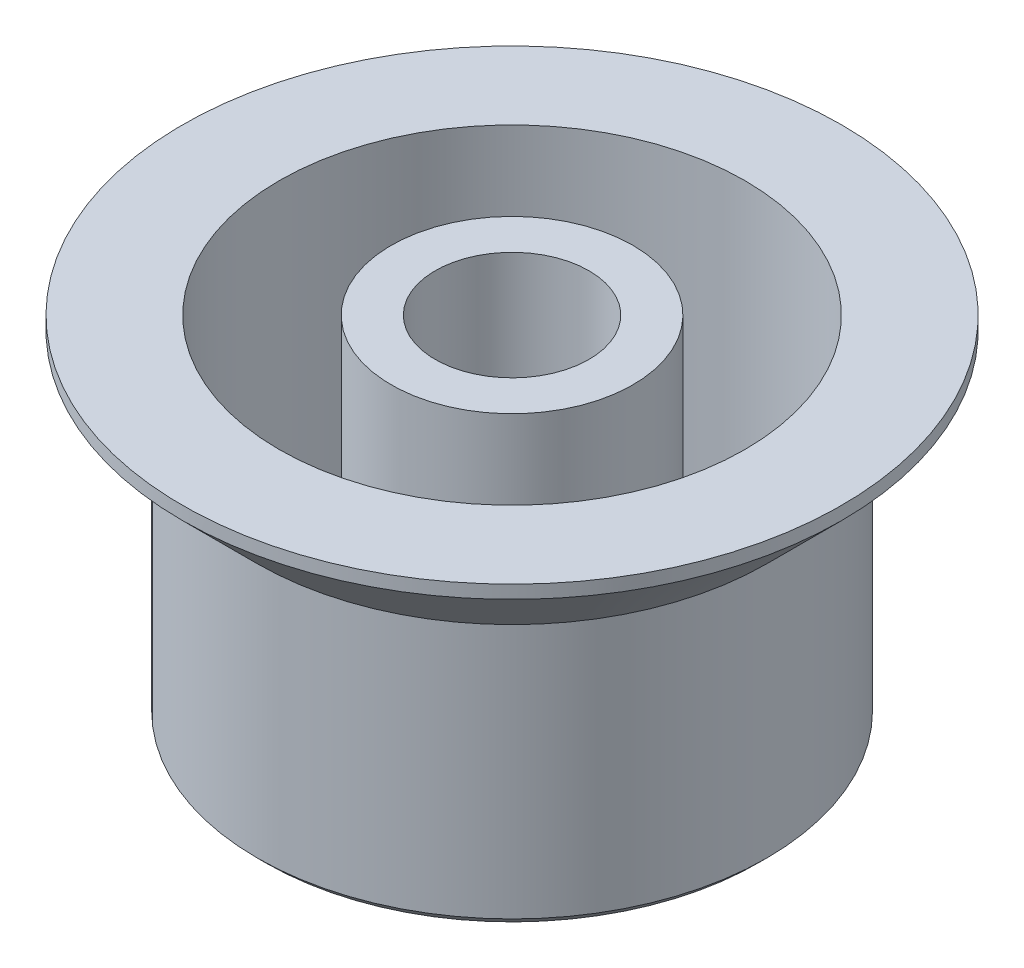
ISO-10303-21;
HEADER;
FILE_DESCRIPTION(('STEP AP214'),'2;1');
FILE_NAME('part.step','',(''),(''),'','','');
FILE_SCHEMA(('AUTOMOTIVE_DESIGN { 1 0 10303 214 1 1 1 1 }'));
ENDSEC;
DATA;
#1=APPLICATION_CONTEXT('core data for automotive mechanical design processes');
#2=APPLICATION_PROTOCOL_DEFINITION('international standard','automotive_design',2000,#1);
#3=PRODUCT_CONTEXT('',#1,'mechanical');
#4=PRODUCT('Part','Part','',(#3));
#5=PRODUCT_RELATED_PRODUCT_CATEGORY('part','',(#4));
#6=PRODUCT_DEFINITION_FORMATION('','',#4);
#7=PRODUCT_DEFINITION_CONTEXT('part definition',#1,'design');
#8=PRODUCT_DEFINITION('design','',#6,#7);
#9=PRODUCT_DEFINITION_SHAPE('','',#8);
#10=(LENGTH_UNIT() NAMED_UNIT(*) SI_UNIT(.MILLI.,.METRE.));
#11=(NAMED_UNIT(*) PLANE_ANGLE_UNIT() SI_UNIT($,.RADIAN.));
#12=(NAMED_UNIT(*) SI_UNIT($,.STERADIAN.) SOLID_ANGLE_UNIT());
#13=UNCERTAINTY_MEASURE_WITH_UNIT(LENGTH_MEASURE(1.E-05),#10,'distance_accuracy_value','');
#14=(GEOMETRIC_REPRESENTATION_CONTEXT(3) GLOBAL_UNCERTAINTY_ASSIGNED_CONTEXT((#13)) GLOBAL_UNIT_ASSIGNED_CONTEXT((#10,
#11,#12)) REPRESENTATION_CONTEXT('',''));
#15=CARTESIAN_POINT('',(0.,0.,0.));
#16=DIRECTION('',(0.,0.,1.));
#17=DIRECTION('',(1.,0.,0.));
#18=AXIS2_PLACEMENT_3D('',#15,#16,#17);
#19=CARTESIAN_POINT('',(166.750080550188,-52.9999315973919,-82.7209999999947));
#20=DIRECTION('',(0.,1.,0.));
#21=DIRECTION('',(0.,0.,1.));
#22=AXIS2_PLACEMENT_3D('',#19,#20,#21);
#23=PLANE('',#22);
#24=CARTESIAN_POINT('',(166.750080550188,-52.9999315973919,-82.7209999999947));
#25=DIRECTION('',(0.,1.,0.));
#26=DIRECTION('',(0.,0.,1.));
#27=AXIS2_PLACEMENT_3D('',#24,#25,#26);
#28=CIRCLE('',#27,11.2);
#29=CARTESIAN_POINT('',(166.750080550188,-52.9999315973919,-71.5209999999947));
#30=VERTEX_POINT('',#29);
#31=EDGE_CURVE('E18',#30,#30,#28,.T.);
#32=ORIENTED_EDGE('',*,*,#31,.F.);
#33=EDGE_LOOP('',(#32));
#34=FACE_BOUND('',#33,.T.);
#35=ADVANCED_FACE('F15',(#34),#23,.F.);
#36=CARTESIAN_POINT('',(166.750080550188,-50.9999315973919,-82.7209999999947));
#37=DIRECTION('',(0.,-1.,0.));
#38=DIRECTION('',(0.,0.,-1.));
#39=AXIS2_PLACEMENT_3D('',#36,#37,#38);
#40=PLANE('',#39);
#41=CARTESIAN_POINT('',(166.750080550188,-50.9999315973919,-82.7209999999947));
#42=DIRECTION('',(0.,-1.,0.));
#43=DIRECTION('',(0.,0.,-1.));
#44=AXIS2_PLACEMENT_3D('',#41,#42,#43);
#45=CIRCLE('',#44,3.5);
#46=CARTESIAN_POINT('',(166.750080550188,-50.9999315973919,-86.2209999999947));
#47=VERTEX_POINT('',#46);
#48=EDGE_CURVE('E45',#47,#47,#45,.F.);
#49=ORIENTED_EDGE('',*,*,#48,.T.);
#50=EDGE_LOOP('',(#49));
#51=FACE_BOUND('',#50,.T.);
#52=ADVANCED_FACE('F56',(#51),#40,.F.);
#53=CARTESIAN_POINT('',(166.750080550188,-52.5999315973919,-82.7209999999947));
#54=DIRECTION('',(0.,1.,0.));
#55=DIRECTION('',(0.,0.,1.));
#56=AXIS2_PLACEMENT_3D('',#53,#54,#55);
#57=CONICAL_SURFACE('',#56,11.6,0.785398163397448);
#58=CARTESIAN_POINT('',(166.750080550188,-52.5999315973919,-82.7209999999947));
#59=DIRECTION('',(0.,1.,0.));
#60=DIRECTION('',(0.,0.,1.));
#61=AXIS2_PLACEMENT_3D('',#58,#59,#60);
#62=CIRCLE('',#61,11.6);
#63=CARTESIAN_POINT('',(166.750080550188,-52.5999315973919,-71.1209999999947));
#64=VERTEX_POINT('',#63);
#65=EDGE_CURVE('E44',#64,#64,#62,.T.);
#66=ORIENTED_EDGE('',*,*,#65,.F.);
#67=EDGE_LOOP('',(#66));
#68=FACE_BOUND('',#67,.T.);
#69=ORIENTED_EDGE('',*,*,#31,.T.);
#70=EDGE_LOOP('',(#69));
#71=FACE_BOUND('',#70,.T.);
#72=ADVANCED_FACE('F53',(#68,#71),#57,.T.);
#73=CARTESIAN_POINT('',(166.750080550188,-36.9999315973919,-82.7209999999947));
#74=DIRECTION('',(0.,-1.,0.));
#75=DIRECTION('',(0.,0.,-1.));
#76=AXIS2_PLACEMENT_3D('',#73,#74,#75);
#77=CYLINDRICAL_SURFACE('',#76,3.5);
#78=CARTESIAN_POINT('',(166.750080550188,-36.9999315973919,-82.7209999999947));
#79=DIRECTION('',(0.,-1.,0.));
#80=DIRECTION('',(0.,0.,-1.));
#81=AXIS2_PLACEMENT_3D('',#78,#79,#80);
#82=CIRCLE('',#81,3.5);
#83=CARTESIAN_POINT('',(166.750080550188,-36.9999315973919,-86.2209999999947));
#84=VERTEX_POINT('',#83);
#85=EDGE_CURVE('E42',#84,#84,#82,.T.);
#86=ORIENTED_EDGE('',*,*,#85,.F.);
#87=EDGE_LOOP('',(#86));
#88=FACE_BOUND('',#87,.T.);
#89=ORIENTED_EDGE('',*,*,#48,.F.);
#90=EDGE_LOOP('',(#89));
#91=FACE_BOUND('',#90,.T.);
#92=ADVANCED_FACE('F96',(#88,#91),#77,.F.);
#93=CARTESIAN_POINT('',(166.750080550188,-52.9999315973919,-82.7209999999947));
#94=DIRECTION('',(0.,1.,0.));
#95=DIRECTION('',(0.,0.,1.));
#96=AXIS2_PLACEMENT_3D('',#93,#94,#95);
#97=CYLINDRICAL_SURFACE('',#96,11.6);
#98=CARTESIAN_POINT('',(166.750080550188,-40.9999315973919,-82.7209999999947));
#99=DIRECTION('',(0.,1.,0.));
#100=DIRECTION('',(1.,0.,0.));
#101=AXIS2_PLACEMENT_3D('',#98,#99,#100);
#102=CIRCLE('',#101,11.6);
#103=CARTESIAN_POINT('',(178.350080550188,-40.9999315973919,-82.7209999999947));
#104=VERTEX_POINT('',#103);
#105=EDGE_CURVE('E30',#104,#104,#102,.T.);
#106=ORIENTED_EDGE('',*,*,#105,.F.);
#107=EDGE_LOOP('',(#106));
#108=FACE_BOUND('',#107,.T.);
#109=ORIENTED_EDGE('',*,*,#65,.T.);
#110=EDGE_LOOP('',(#109));
#111=FACE_BOUND('',#110,.T.);
#112=ADVANCED_FACE('F92',(#108,#111),#97,.T.);
#113=CARTESIAN_POINT('',(166.750080550188,-36.9999315973919,-82.7209999999947));
#114=DIRECTION('',(0.,1.,0.));
#115=DIRECTION('',(0.,0.,1.));
#116=AXIS2_PLACEMENT_3D('',#113,#114,#115);
#117=PLANE('',#116);
#118=ORIENTED_EDGE('',*,*,#85,.T.);
#119=EDGE_LOOP('',(#118));
#120=FACE_BOUND('',#119,.T.);
#121=CARTESIAN_POINT('',(166.750080550188,-36.9999315973919,-82.7209999999947));
#122=DIRECTION('',(0.,-1.,0.));
#123=DIRECTION('',(0.,0.,-1.));
#124=AXIS2_PLACEMENT_3D('',#121,#122,#123);
#125=CIRCLE('',#124,5.49999999999997);
#126=CARTESIAN_POINT('',(166.750080550188,-36.9999315973919,-88.2209999999947));
#127=VERTEX_POINT('',#126);
#128=EDGE_CURVE('E39',#127,#127,#125,.T.);
#129=ORIENTED_EDGE('',*,*,#128,.F.);
#130=EDGE_LOOP('',(#129));
#131=FACE_BOUND('',#130,.T.);
#132=ADVANCED_FACE('F88',(#120,#131),#117,.T.);
#133=CARTESIAN_POINT('',(166.750080550188,-37.5999315973919,-82.7209999999947));
#134=DIRECTION('',(0.,1.,0.));
#135=DIRECTION('',(0.,0.,1.));
#136=AXIS2_PLACEMENT_3D('',#133,#134,#135);
#137=CONICAL_SURFACE('',#136,15.,0.785398163397448);
#138=ORIENTED_EDGE('',*,*,#105,.T.);
#139=EDGE_LOOP('',(#138));
#140=FACE_BOUND('',#139,.T.);
#141=CARTESIAN_POINT('',(166.750080550188,-37.5999315973919,-82.7209999999947));
#142=DIRECTION('',(0.,-1.,0.));
#143=DIRECTION('',(0.,0.,-1.));
#144=AXIS2_PLACEMENT_3D('',#141,#142,#143);
#145=CIRCLE('',#144,15.);
#146=CARTESIAN_POINT('',(166.750080550188,-37.5999315973919,-97.7209999999947));
#147=VERTEX_POINT('',#146);
#148=EDGE_CURVE('E38',#147,#147,#145,.F.);
#149=ORIENTED_EDGE('',*,*,#148,.F.);
#150=EDGE_LOOP('',(#149));
#151=FACE_BOUND('',#150,.T.);
#152=ADVANCED_FACE('F84',(#140,#151),#137,.T.);
#153=CARTESIAN_POINT('',(166.750080550188,-36.9999315973919,-82.7209999999947));
#154=DIRECTION('',(0.,-1.,0.));
#155=DIRECTION('',(0.,0.,-1.));
#156=AXIS2_PLACEMENT_3D('',#153,#154,#155);
#157=CYLINDRICAL_SURFACE('',#156,5.49999999999997);
#158=CARTESIAN_POINT('',(166.750080550188,-50.9999315973919,-82.7209999999947));
#159=DIRECTION('',(0.,-1.,0.));
#160=DIRECTION('',(0.,0.,-1.));
#161=AXIS2_PLACEMENT_3D('',#158,#159,#160);
#162=CIRCLE('',#161,5.49999999999997);
#163=CARTESIAN_POINT('',(166.750080550188,-50.9999315973919,-88.2209999999947));
#164=VERTEX_POINT('',#163);
#165=EDGE_CURVE('E35',#164,#164,#162,.T.);
#166=ORIENTED_EDGE('',*,*,#165,.F.);
#167=EDGE_LOOP('',(#166));
#168=FACE_BOUND('',#167,.T.);
#169=ORIENTED_EDGE('',*,*,#128,.T.);
#170=EDGE_LOOP('',(#169));
#171=FACE_BOUND('',#170,.T.);
#172=ADVANCED_FACE('F80',(#168,#171),#157,.T.);
#173=CARTESIAN_POINT('',(166.750080550188,-36.9999315973919,-82.7209999999947));
#174=DIRECTION('',(0.,-1.,0.));
#175=DIRECTION('',(0.,0.,-1.));
#176=AXIS2_PLACEMENT_3D('',#173,#174,#175);
#177=CYLINDRICAL_SURFACE('',#176,15.);
#178=CARTESIAN_POINT('',(166.750080550188,-36.9999315973919,-82.7209999999947));
#179=DIRECTION('',(0.,-1.,0.));
#180=DIRECTION('',(0.,0.,-1.));
#181=AXIS2_PLACEMENT_3D('',#178,#179,#180);
#182=CIRCLE('',#181,15.);
#183=CARTESIAN_POINT('',(166.750080550188,-36.9999315973919,-97.7209999999947));
#184=VERTEX_POINT('',#183);
#185=EDGE_CURVE('E27',#184,#184,#182,.F.);
#186=ORIENTED_EDGE('',*,*,#185,.F.);
#187=EDGE_LOOP('',(#186));
#188=FACE_BOUND('',#187,.T.);
#189=ORIENTED_EDGE('',*,*,#148,.T.);
#190=EDGE_LOOP('',(#189));
#191=FACE_BOUND('',#190,.T.);
#192=ADVANCED_FACE('F76',(#188,#191),#177,.T.);
#193=CARTESIAN_POINT('',(166.750080550188,-50.9999315973919,-82.7209999999947));
#194=DIRECTION('',(0.,1.,0.));
#195=DIRECTION('',(0.,0.,1.));
#196=AXIS2_PLACEMENT_3D('',#193,#194,#195);
#197=PLANE('',#196);
#198=ORIENTED_EDGE('',*,*,#165,.T.);
#199=EDGE_LOOP('',(#198));
#200=FACE_BOUND('',#199,.T.);
#201=CARTESIAN_POINT('',(166.750080550188,-50.9999315973919,-82.7209999999947));
#202=DIRECTION('',(0.,-1.,0.));
#203=DIRECTION('',(0.,0.,-1.));
#204=AXIS2_PLACEMENT_3D('',#201,#202,#203);
#205=CIRCLE('',#204,10.6);
#206=CARTESIAN_POINT('',(166.750080550188,-50.9999315973919,-93.3209999999947));
#207=VERTEX_POINT('',#206);
#208=EDGE_CURVE('E22',#207,#207,#205,.F.);
#209=ORIENTED_EDGE('',*,*,#208,.T.);
#210=EDGE_LOOP('',(#209));
#211=FACE_BOUND('',#210,.T.);
#212=ADVANCED_FACE('F69',(#200,#211),#197,.T.);
#213=CARTESIAN_POINT('',(166.750080550188,-36.9999315973919,-82.7209999999947));
#214=DIRECTION('',(0.,1.,0.));
#215=DIRECTION('',(0.,0.,1.));
#216=AXIS2_PLACEMENT_3D('',#213,#214,#215);
#217=PLANE('',#216);
#218=CARTESIAN_POINT('',(166.750080550188,-36.9999315973919,-82.7209999999947));
#219=DIRECTION('',(0.,-1.,0.));
#220=DIRECTION('',(0.,0.,-1.));
#221=AXIS2_PLACEMENT_3D('',#218,#219,#220);
#222=CIRCLE('',#221,10.6);
#223=CARTESIAN_POINT('',(166.750080550188,-36.9999315973919,-93.3209999999947));
#224=VERTEX_POINT('',#223);
#225=EDGE_CURVE('E10',#224,#224,#222,.T.);
#226=ORIENTED_EDGE('',*,*,#225,.T.);
#227=EDGE_LOOP('',(#226));
#228=FACE_BOUND('',#227,.T.);
#229=ORIENTED_EDGE('',*,*,#185,.T.);
#230=EDGE_LOOP('',(#229));
#231=FACE_BOUND('',#230,.T.);
#232=ADVANCED_FACE('F63',(#228,#231),#217,.T.);
#233=CARTESIAN_POINT('',(166.750080550188,-36.9999315973919,-82.7209999999947));
#234=DIRECTION('',(0.,-1.,0.));
#235=DIRECTION('',(0.,0.,-1.));
#236=AXIS2_PLACEMENT_3D('',#233,#234,#235);
#237=CYLINDRICAL_SURFACE('',#236,10.6);
#238=ORIENTED_EDGE('',*,*,#208,.F.);
#239=EDGE_LOOP('',(#238));
#240=FACE_BOUND('',#239,.T.);
#241=ORIENTED_EDGE('',*,*,#225,.F.);
#242=EDGE_LOOP('',(#241));
#243=FACE_BOUND('',#242,.T.);
#244=ADVANCED_FACE('F61',(#240,#243),#237,.F.);
#245=CLOSED_SHELL('',(#35,#52,#72,#92,#112,#132,#152,#172,#192,#212,#232,#244));
#246=MANIFOLD_SOLID_BREP('B1',#245);
#247=ADVANCED_BREP_SHAPE_REPRESENTATION('',(#18,#246),#14);
#248=SHAPE_DEFINITION_REPRESENTATION(#9,#247);
ENDSEC;
END-ISO-10303-21;
